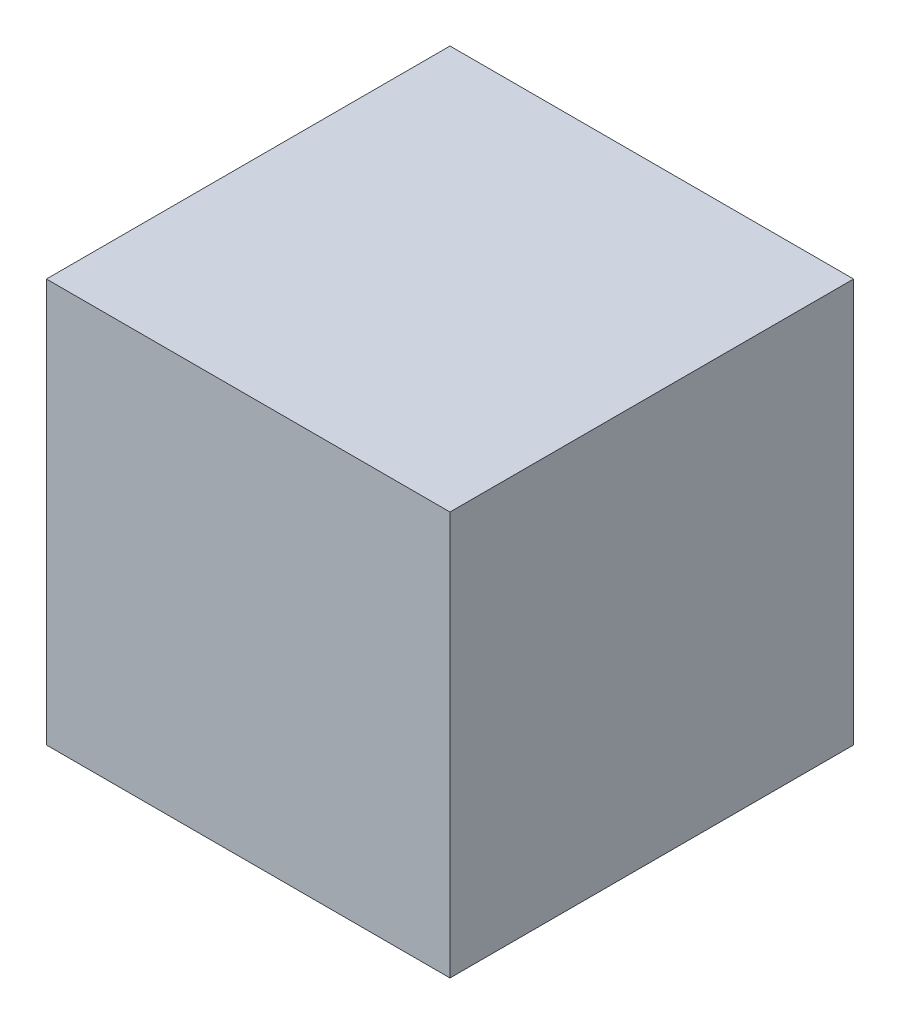
ISO-10303-21;
HEADER;
FILE_DESCRIPTION(('STEP AP214'),'2;1');
FILE_NAME('part.step','',(''),(''),'','','');
FILE_SCHEMA(('AUTOMOTIVE_DESIGN { 1 0 10303 214 1 1 1 1 }'));
ENDSEC;
DATA;
#1=APPLICATION_CONTEXT('core data for automotive mechanical design processes');
#2=APPLICATION_PROTOCOL_DEFINITION('international standard','automotive_design',2000,#1);
#3=PRODUCT_CONTEXT('',#1,'mechanical');
#4=PRODUCT('Part','Part','',(#3));
#5=PRODUCT_RELATED_PRODUCT_CATEGORY('part','',(#4));
#6=PRODUCT_DEFINITION_FORMATION('','',#4);
#7=PRODUCT_DEFINITION_CONTEXT('part definition',#1,'design');
#8=PRODUCT_DEFINITION('design','',#6,#7);
#9=PRODUCT_DEFINITION_SHAPE('','',#8);
#10=(LENGTH_UNIT() NAMED_UNIT(*) SI_UNIT(.MILLI.,.METRE.));
#11=(NAMED_UNIT(*) PLANE_ANGLE_UNIT() SI_UNIT($,.RADIAN.));
#12=(NAMED_UNIT(*) SI_UNIT($,.STERADIAN.) SOLID_ANGLE_UNIT());
#13=UNCERTAINTY_MEASURE_WITH_UNIT(LENGTH_MEASURE(1.E-05),#10,'distance_accuracy_value','');
#14=(GEOMETRIC_REPRESENTATION_CONTEXT(3) GLOBAL_UNCERTAINTY_ASSIGNED_CONTEXT((#13)) GLOBAL_UNIT_ASSIGNED_CONTEXT((#10,
#11,#12)) REPRESENTATION_CONTEXT('',''));
#15=CARTESIAN_POINT('',(0.,0.,0.));
#16=DIRECTION('',(0.,0.,1.));
#17=DIRECTION('',(1.,0.,0.));
#18=AXIS2_PLACEMENT_3D('',#15,#16,#17);
#19=CARTESIAN_POINT('',(0.,0.,127.));
#20=DIRECTION('',(1.,0.,0.));
#21=DIRECTION('',(0.,0.,-1.));
#22=AXIS2_PLACEMENT_3D('',#19,#20,#21);
#23=PLANE('',#22);
#24=DIRECTION('',(0.,-1.,0.));
#25=VECTOR('',#24,1.);
#26=CARTESIAN_POINT('',(0.,0.,0.));
#27=LINE('',#26,#25);
#28=CARTESIAN_POINT('',(0.,127.,0.));
#29=VERTEX_POINT('',#28);
#30=CARTESIAN_POINT('',(0.,0.,0.));
#31=VERTEX_POINT('',#30);
#32=EDGE_CURVE('E100',#29,#31,#27,.T.);
#33=ORIENTED_EDGE('',*,*,#32,.T.);
#34=DIRECTION('',(0.,0.,-1.));
#35=VECTOR('',#34,1.);
#36=CARTESIAN_POINT('',(0.,0.,127.));
#37=LINE('',#36,#35);
#38=CARTESIAN_POINT('',(0.,0.,127.));
#39=VERTEX_POINT('',#38);
#40=EDGE_CURVE('E11',#39,#31,#37,.T.);
#41=ORIENTED_EDGE('',*,*,#40,.F.);
#42=DIRECTION('',(0.,-1.,0.));
#43=VECTOR('',#42,1.);
#44=CARTESIAN_POINT('',(0.,0.,127.));
#45=LINE('',#44,#43);
#46=CARTESIAN_POINT('',(0.,127.,127.));
#47=VERTEX_POINT('',#46);
#48=EDGE_CURVE('E88',#47,#39,#45,.T.);
#49=ORIENTED_EDGE('',*,*,#48,.F.);
#50=DIRECTION('',(0.,0.,-1.));
#51=VECTOR('',#50,1.);
#52=CARTESIAN_POINT('',(0.,127.,127.));
#53=LINE('',#52,#51);
#54=EDGE_CURVE('E96',#47,#29,#53,.T.);
#55=ORIENTED_EDGE('',*,*,#54,.T.);
#56=EDGE_LOOP('',(#33,#41,#49,#55));
#57=FACE_BOUND('',#56,.T.);
#58=ADVANCED_FACE('F37',(#57),#23,.F.);
#59=CARTESIAN_POINT('',(0.,0.,127.));
#60=DIRECTION('',(0.,1.,0.));
#61=DIRECTION('',(0.,0.,1.));
#62=AXIS2_PLACEMENT_3D('',#59,#60,#61);
#63=PLANE('',#62);
#64=DIRECTION('',(1.,0.,0.));
#65=VECTOR('',#64,1.);
#66=CARTESIAN_POINT('',(0.,0.,0.));
#67=LINE('',#66,#65);
#68=CARTESIAN_POINT('',(127.,0.,0.));
#69=VERTEX_POINT('',#68);
#70=EDGE_CURVE('E92',#31,#69,#67,.T.);
#71=ORIENTED_EDGE('',*,*,#70,.T.);
#72=DIRECTION('',(0.,0.,-1.));
#73=VECTOR('',#72,1.);
#74=CARTESIAN_POINT('',(127.,0.,127.));
#75=LINE('',#74,#73);
#76=CARTESIAN_POINT('',(127.,0.,127.));
#77=VERTEX_POINT('',#76);
#78=EDGE_CURVE('E45',#77,#69,#75,.T.);
#79=ORIENTED_EDGE('',*,*,#78,.F.);
#80=DIRECTION('',(1.,0.,0.));
#81=VECTOR('',#80,1.);
#82=CARTESIAN_POINT('',(0.,0.,127.));
#83=LINE('',#82,#81);
#84=EDGE_CURVE('E83',#39,#77,#83,.T.);
#85=ORIENTED_EDGE('',*,*,#84,.F.);
#86=ORIENTED_EDGE('',*,*,#40,.T.);
#87=EDGE_LOOP('',(#71,#79,#85,#86));
#88=FACE_BOUND('',#87,.T.);
#89=ADVANCED_FACE('F91',(#88),#63,.F.);
#90=CARTESIAN_POINT('',(127.,0.,127.));
#91=DIRECTION('',(-1.,0.,0.));
#92=DIRECTION('',(0.,0.,1.));
#93=AXIS2_PLACEMENT_3D('',#90,#91,#92);
#94=PLANE('',#93);
#95=DIRECTION('',(0.,1.,0.));
#96=VECTOR('',#95,1.);
#97=CARTESIAN_POINT('',(127.,0.,0.));
#98=LINE('',#97,#96);
#99=CARTESIAN_POINT('',(127.,127.,0.));
#100=VERTEX_POINT('',#99);
#101=EDGE_CURVE('E70',#69,#100,#98,.T.);
#102=ORIENTED_EDGE('',*,*,#101,.T.);
#103=DIRECTION('',(0.,0.,-1.));
#104=VECTOR('',#103,1.);
#105=CARTESIAN_POINT('',(127.,127.,127.));
#106=LINE('',#105,#104);
#107=CARTESIAN_POINT('',(127.,127.,127.));
#108=VERTEX_POINT('',#107);
#109=EDGE_CURVE('E93',#108,#100,#106,.T.);
#110=ORIENTED_EDGE('',*,*,#109,.F.);
#111=DIRECTION('',(0.,1.,0.));
#112=VECTOR('',#111,1.);
#113=CARTESIAN_POINT('',(127.,0.,127.));
#114=LINE('',#113,#112);
#115=EDGE_CURVE('E86',#77,#108,#114,.T.);
#116=ORIENTED_EDGE('',*,*,#115,.F.);
#117=ORIENTED_EDGE('',*,*,#78,.T.);
#118=EDGE_LOOP('',(#102,#110,#116,#117));
#119=FACE_BOUND('',#118,.T.);
#120=ADVANCED_FACE('F94',(#119),#94,.F.);
#121=CARTESIAN_POINT('',(0.,127.,127.));
#122=DIRECTION('',(0.,-1.,0.));
#123=DIRECTION('',(0.,0.,-1.));
#124=AXIS2_PLACEMENT_3D('',#121,#122,#123);
#125=PLANE('',#124);
#126=DIRECTION('',(-1.,0.,0.));
#127=VECTOR('',#126,1.);
#128=CARTESIAN_POINT('',(0.,127.,0.));
#129=LINE('',#128,#127);
#130=EDGE_CURVE('E76',#100,#29,#129,.T.);
#131=ORIENTED_EDGE('',*,*,#130,.T.);
#132=ORIENTED_EDGE('',*,*,#54,.F.);
#133=DIRECTION('',(-1.,0.,0.));
#134=VECTOR('',#133,1.);
#135=CARTESIAN_POINT('',(0.,127.,127.));
#136=LINE('',#135,#134);
#137=EDGE_CURVE('E53',#108,#47,#136,.T.);
#138=ORIENTED_EDGE('',*,*,#137,.F.);
#139=ORIENTED_EDGE('',*,*,#109,.T.);
#140=EDGE_LOOP('',(#131,#132,#138,#139));
#141=FACE_BOUND('',#140,.T.);
#142=ADVANCED_FACE('F107',(#141),#125,.F.);
#143=CARTESIAN_POINT('',(0.,0.,127.));
#144=DIRECTION('',(0.,0.,-1.));
#145=DIRECTION('',(-1.,0.,0.));
#146=AXIS2_PLACEMENT_3D('',#143,#144,#145);
#147=PLANE('',#146);
#148=ORIENTED_EDGE('',*,*,#48,.T.);
#149=ORIENTED_EDGE('',*,*,#84,.T.);
#150=ORIENTED_EDGE('',*,*,#115,.T.);
#151=ORIENTED_EDGE('',*,*,#137,.T.);
#152=EDGE_LOOP('',(#148,#149,#150,#151));
#153=FACE_BOUND('',#152,.T.);
#154=ADVANCED_FACE('F84',(#153),#147,.F.);
#155=CARTESIAN_POINT('',(0.,0.,0.));
#156=DIRECTION('',(0.,0.,-1.));
#157=DIRECTION('',(-1.,0.,0.));
#158=AXIS2_PLACEMENT_3D('',#155,#156,#157);
#159=PLANE('',#158);
#160=ORIENTED_EDGE('',*,*,#32,.F.);
#161=ORIENTED_EDGE('',*,*,#130,.F.);
#162=ORIENTED_EDGE('',*,*,#101,.F.);
#163=ORIENTED_EDGE('',*,*,#70,.F.);
#164=EDGE_LOOP('',(#160,#161,#162,#163));
#165=FACE_BOUND('',#164,.T.);
#166=ADVANCED_FACE('F110',(#165),#159,.T.);
#167=CLOSED_SHELL('',(#58,#89,#120,#142,#154,#166));
#168=MANIFOLD_SOLID_BREP('B2',#167);
#169=ADVANCED_BREP_SHAPE_REPRESENTATION('',(#18,#168),#14);
#170=SHAPE_DEFINITION_REPRESENTATION(#9,#169);
ENDSEC;
END-ISO-10303-21;
